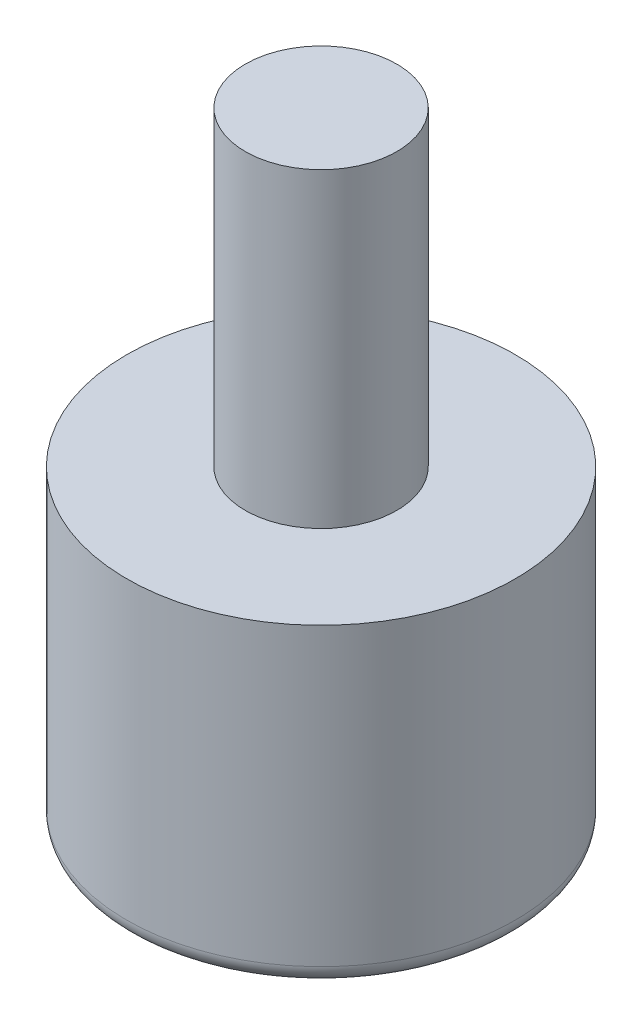
ISO-10303-21;
HEADER;
FILE_DESCRIPTION(('STEP AP214'),'2;1');
FILE_NAME('part.step','',(''),(''),'','','');
FILE_SCHEMA(('AUTOMOTIVE_DESIGN { 1 0 10303 214 1 1 1 1 }'));
ENDSEC;
DATA;
#1=APPLICATION_CONTEXT('core data for automotive mechanical design processes');
#2=APPLICATION_PROTOCOL_DEFINITION('international standard','automotive_design',2000,#1);
#3=PRODUCT_CONTEXT('',#1,'mechanical');
#4=PRODUCT('Part','Part','',(#3));
#5=PRODUCT_RELATED_PRODUCT_CATEGORY('part','',(#4));
#6=PRODUCT_DEFINITION_FORMATION('','',#4);
#7=PRODUCT_DEFINITION_CONTEXT('part definition',#1,'design');
#8=PRODUCT_DEFINITION('design','',#6,#7);
#9=PRODUCT_DEFINITION_SHAPE('','',#8);
#10=(LENGTH_UNIT() NAMED_UNIT(*) SI_UNIT(.MILLI.,.METRE.));
#11=(NAMED_UNIT(*) PLANE_ANGLE_UNIT() SI_UNIT($,.RADIAN.));
#12=(NAMED_UNIT(*) SI_UNIT($,.STERADIAN.) SOLID_ANGLE_UNIT());
#13=UNCERTAINTY_MEASURE_WITH_UNIT(LENGTH_MEASURE(1.E-05),#10,'distance_accuracy_value','');
#14=(GEOMETRIC_REPRESENTATION_CONTEXT(3) GLOBAL_UNCERTAINTY_ASSIGNED_CONTEXT((#13)) GLOBAL_UNIT_ASSIGNED_CONTEXT((#10,
#11,#12)) REPRESENTATION_CONTEXT('',''));
#15=CARTESIAN_POINT('',(0.,0.,0.));
#16=DIRECTION('',(0.,0.,1.));
#17=DIRECTION('',(1.,0.,0.));
#18=AXIS2_PLACEMENT_3D('',#15,#16,#17);
#19=CARTESIAN_POINT('',(0.,3.59411764705882,0.));
#20=DIRECTION('',(0.,1.,0.));
#21=DIRECTION('',(1.,0.,0.));
#22=AXIS2_PLACEMENT_3D('',#19,#20,#21);
#23=SPHERICAL_SURFACE('',#22,6.99411764705882);
#24=CARTESIAN_POINT('',(0.,0.,0.));
#25=DIRECTION('',(0.,1.,0.));
#26=DIRECTION('',(-1.,0.,0.));
#27=AXIS2_PLACEMENT_3D('',#24,#25,#26);
#28=CIRCLE('',#27,6.);
#29=CARTESIAN_POINT('',(-6.,0.,0.));
#30=VERTEX_POINT('',#29);
#31=EDGE_CURVE('E55',#30,#30,#28,.T.);
#32=ORIENTED_EDGE('',*,*,#31,.F.);
#33=EDGE_LOOP('',(#32));
#34=FACE_BOUND('',#33,.T.);
#35=ADVANCED_FACE('F32',(#34),#23,.T.);
#36=CARTESIAN_POINT('',(4.,33.,0.));
#37=DIRECTION('',(0.,-1.,0.));
#38=DIRECTION('',(1.,0.,0.));
#39=AXIS2_PLACEMENT_3D('',#36,#37,#38);
#40=PLANE('',#39);
#41=CARTESIAN_POINT('',(0.,33.,0.));
#42=DIRECTION('',(0.,1.,0.));
#43=DIRECTION('',(-1.,0.,0.));
#44=AXIS2_PLACEMENT_3D('',#41,#42,#43);
#45=CIRCLE('',#44,4.);
#46=CARTESIAN_POINT('',(-4.,33.,0.));
#47=VERTEX_POINT('',#46);
#48=EDGE_CURVE('E43',#47,#47,#45,.T.);
#49=ORIENTED_EDGE('',*,*,#48,.T.);
#50=EDGE_LOOP('',(#49));
#51=FACE_BOUND('',#50,.T.);
#52=ADVANCED_FACE('F62',(#51),#40,.F.);
#53=CARTESIAN_POINT('',(0.,33.,0.));
#54=DIRECTION('',(0.,1.,0.));
#55=DIRECTION('',(-1.,0.,0.));
#56=AXIS2_PLACEMENT_3D('',#53,#54,#55);
#57=CYLINDRICAL_SURFACE('',#56,4.);
#58=ORIENTED_EDGE('',*,*,#48,.F.);
#59=EDGE_LOOP('',(#58));
#60=FACE_BOUND('',#59,.T.);
#61=CARTESIAN_POINT('',(0.,16.6,0.));
#62=DIRECTION('',(0.,1.,0.));
#63=DIRECTION('',(-1.,0.,0.));
#64=AXIS2_PLACEMENT_3D('',#61,#62,#63);
#65=CIRCLE('',#64,4.);
#66=CARTESIAN_POINT('',(-4.,16.6,0.));
#67=VERTEX_POINT('',#66);
#68=EDGE_CURVE('E47',#67,#67,#65,.T.);
#69=ORIENTED_EDGE('',*,*,#68,.T.);
#70=EDGE_LOOP('',(#69));
#71=FACE_BOUND('',#70,.T.);
#72=ADVANCED_FACE('F66',(#60,#71),#57,.T.);
#73=CARTESIAN_POINT('',(10.25,16.6,0.));
#74=DIRECTION('',(0.,-1.,0.));
#75=DIRECTION('',(1.,0.,0.));
#76=AXIS2_PLACEMENT_3D('',#73,#74,#75);
#77=PLANE('',#76);
#78=ORIENTED_EDGE('',*,*,#68,.F.);
#79=EDGE_LOOP('',(#78));
#80=FACE_BOUND('',#79,.T.);
#81=CARTESIAN_POINT('',(0.,16.6,0.));
#82=DIRECTION('',(0.,1.,0.));
#83=DIRECTION('',(-1.,0.,0.));
#84=AXIS2_PLACEMENT_3D('',#81,#82,#83);
#85=CIRCLE('',#84,10.25);
#86=CARTESIAN_POINT('',(-10.25,16.6,0.));
#87=VERTEX_POINT('',#86);
#88=EDGE_CURVE('E52',#87,#87,#85,.T.);
#89=ORIENTED_EDGE('',*,*,#88,.T.);
#90=EDGE_LOOP('',(#89));
#91=FACE_BOUND('',#90,.T.);
#92=ADVANCED_FACE('F72',(#80,#91),#77,.F.);
#93=CARTESIAN_POINT('',(0.,33.,0.));
#94=DIRECTION('',(0.,1.,0.));
#95=DIRECTION('',(-1.,0.,0.));
#96=AXIS2_PLACEMENT_3D('',#93,#94,#95);
#97=CYLINDRICAL_SURFACE('',#96,10.25);
#98=CARTESIAN_POINT('',(0.,1.,0.));
#99=DIRECTION('',(0.,1.,0.));
#100=DIRECTION('',(-1.,0.,0.));
#101=AXIS2_PLACEMENT_3D('',#98,#99,#100);
#102=CIRCLE('',#101,10.25);
#103=CARTESIAN_POINT('',(-10.25,1.,0.));
#104=VERTEX_POINT('',#103);
#105=EDGE_CURVE('E39',#104,#104,#102,.T.);
#106=ORIENTED_EDGE('',*,*,#105,.T.);
#107=EDGE_LOOP('',(#106));
#108=FACE_BOUND('',#107,.T.);
#109=ORIENTED_EDGE('',*,*,#88,.F.);
#110=EDGE_LOOP('',(#109));
#111=FACE_BOUND('',#110,.T.);
#112=ADVANCED_FACE('F76',(#108,#111),#97,.T.);
#113=CARTESIAN_POINT('',(10.25,0.,0.));
#114=DIRECTION('',(0.,1.,0.));
#115=DIRECTION('',(-1.,0.,0.));
#116=AXIS2_PLACEMENT_3D('',#113,#114,#115);
#117=PLANE('',#116);
#118=CARTESIAN_POINT('',(0.,0.,0.));
#119=DIRECTION('',(0.,1.,0.));
#120=DIRECTION('',(-1.,0.,0.));
#121=AXIS2_PLACEMENT_3D('',#118,#119,#120);
#122=CIRCLE('',#121,9.25000000000001);
#123=CARTESIAN_POINT('',(-9.25000000000001,0.,0.));
#124=VERTEX_POINT('',#123);
#125=EDGE_CURVE('E10',#124,#124,#122,.F.);
#126=ORIENTED_EDGE('',*,*,#125,.T.);
#127=EDGE_LOOP('',(#126));
#128=FACE_BOUND('',#127,.T.);
#129=ORIENTED_EDGE('',*,*,#31,.T.);
#130=EDGE_LOOP('',(#129));
#131=FACE_BOUND('',#130,.T.);
#132=ADVANCED_FACE('F59',(#128,#131),#117,.F.);
#133=CARTESIAN_POINT('',(0.,1.,0.));
#134=DIRECTION('',(0.,1.,0.));
#135=DIRECTION('',(-1.,0.,0.));
#136=AXIS2_PLACEMENT_3D('',#133,#134,#135);
#137=TOROIDAL_SURFACE('',#136,9.25000000000001,1.);
#138=ORIENTED_EDGE('',*,*,#125,.F.);
#139=EDGE_LOOP('',(#138));
#140=FACE_BOUND('',#139,.T.);
#141=ORIENTED_EDGE('',*,*,#105,.F.);
#142=EDGE_LOOP('',(#141));
#143=FACE_BOUND('',#142,.T.);
#144=ADVANCED_FACE('F34',(#140,#143),#137,.T.);
#145=CLOSED_SHELL('',(#35,#52,#72,#92,#112,#132,#144));
#146=MANIFOLD_SOLID_BREP('B2',#145);
#147=ADVANCED_BREP_SHAPE_REPRESENTATION('',(#18,#146),#14);
#148=SHAPE_DEFINITION_REPRESENTATION(#9,#147);
ENDSEC;
END-ISO-10303-21;
